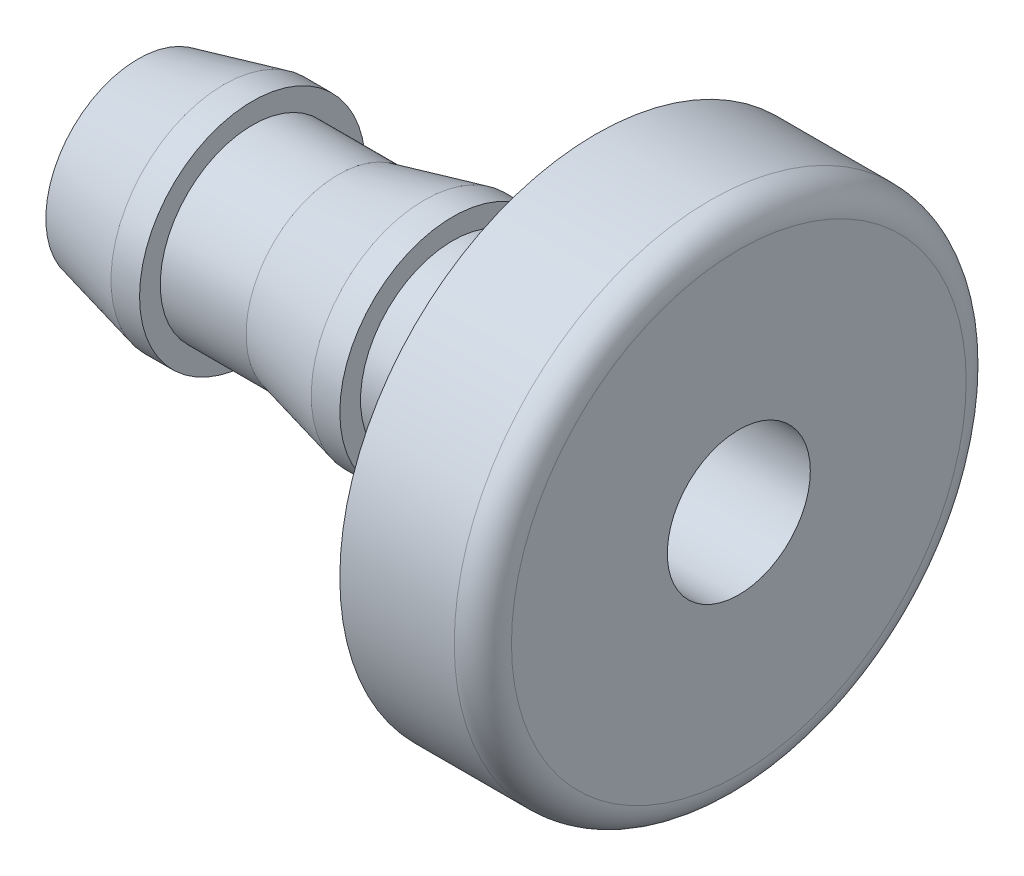
ISO-10303-21;
HEADER;
FILE_DESCRIPTION(('STEP AP214'),'2;1');
FILE_NAME('part.step','',(''),(''),'','','');
FILE_SCHEMA(('AUTOMOTIVE_DESIGN { 1 0 10303 214 1 1 1 1 }'));
ENDSEC;
DATA;
#1=APPLICATION_CONTEXT('core data for automotive mechanical design processes');
#2=APPLICATION_PROTOCOL_DEFINITION('international standard','automotive_design',2000,#1);
#3=PRODUCT_CONTEXT('',#1,'mechanical');
#4=PRODUCT('Part','Part','',(#3));
#5=PRODUCT_RELATED_PRODUCT_CATEGORY('part','',(#4));
#6=PRODUCT_DEFINITION_FORMATION('','',#4);
#7=PRODUCT_DEFINITION_CONTEXT('part definition',#1,'design');
#8=PRODUCT_DEFINITION('design','',#6,#7);
#9=PRODUCT_DEFINITION_SHAPE('','',#8);
#10=(LENGTH_UNIT() NAMED_UNIT(*) SI_UNIT(.MILLI.,.METRE.));
#11=(NAMED_UNIT(*) PLANE_ANGLE_UNIT() SI_UNIT($,.RADIAN.));
#12=(NAMED_UNIT(*) SI_UNIT($,.STERADIAN.) SOLID_ANGLE_UNIT());
#13=UNCERTAINTY_MEASURE_WITH_UNIT(LENGTH_MEASURE(1.E-05),#10,'distance_accuracy_value','');
#14=(GEOMETRIC_REPRESENTATION_CONTEXT(3) GLOBAL_UNCERTAINTY_ASSIGNED_CONTEXT((#13)) GLOBAL_UNIT_ASSIGNED_CONTEXT((#10,
#11,#12)) REPRESENTATION_CONTEXT('',''));
#15=CARTESIAN_POINT('',(0.,0.,0.));
#16=DIRECTION('',(0.,0.,1.));
#17=DIRECTION('',(1.,0.,0.));
#18=AXIS2_PLACEMENT_3D('',#15,#16,#17);
#19=CARTESIAN_POINT('',(10.6172,3.46074999999988,0.));
#20=DIRECTION('',(1.,0.,0.));
#21=DIRECTION('',(0.,0.,-1.));
#22=AXIS2_PLACEMENT_3D('',#19,#20,#21);
#23=PLANE('',#22);
#24=CARTESIAN_POINT('',(10.6172,0.,0.));
#25=DIRECTION('',(1.,0.,0.));
#26=DIRECTION('',(0.,0.,-1.));
#27=AXIS2_PLACEMENT_3D('',#24,#25,#26);
#28=CIRCLE('',#27,3.80999999999995);
#29=CARTESIAN_POINT('',(10.6172,0.,-3.81000000000001));
#30=VERTEX_POINT('',#29);
#31=EDGE_CURVE('E120',#30,#30,#28,.F.);
#32=ORIENTED_EDGE('',*,*,#31,.F.);
#33=EDGE_LOOP('',(#32));
#34=FACE_BOUND('',#33,.T.);
#35=CARTESIAN_POINT('',(10.6172,0.,0.));
#36=DIRECTION('',(1.,0.,0.));
#37=DIRECTION('',(0.,0.,-1.));
#38=AXIS2_PLACEMENT_3D('',#35,#36,#37);
#39=CIRCLE('',#38,3.11149999999995);
#40=CARTESIAN_POINT('',(10.6172,0.,-3.11150000000001));
#41=VERTEX_POINT('',#40);
#42=EDGE_CURVE('E96',#41,#41,#39,.T.);
#43=ORIENTED_EDGE('',*,*,#42,.F.);
#44=EDGE_LOOP('',(#43));
#45=FACE_BOUND('',#44,.T.);
#46=ADVANCED_FACE('F16',(#34,#45),#23,.T.);
#47=CARTESIAN_POINT('',(10.1346,0.,0.));
#48=DIRECTION('',(1.,0.,0.));
#49=DIRECTION('',(0.,0.,-1.));
#50=AXIS2_PLACEMENT_3D('',#47,#48,#49);
#51=CYLINDRICAL_SURFACE('',#50,3.80999999999995);
#52=ORIENTED_EDGE('',*,*,#31,.T.);
#53=EDGE_LOOP('',(#52));
#54=FACE_BOUND('',#53,.T.);
#55=CARTESIAN_POINT('',(9.65199999996003,0.,0.));
#56=DIRECTION('',(1.,0.,0.));
#57=DIRECTION('',(0.,1.,0.));
#58=AXIS2_PLACEMENT_3D('',#55,#56,#57);
#59=CIRCLE('',#58,3.81000000000149);
#60=CARTESIAN_POINT('',(9.65199999996003,3.81000000000142,0.));
#61=VERTEX_POINT('',#60);
#62=EDGE_CURVE('E93',#61,#61,#59,.F.);
#63=ORIENTED_EDGE('',*,*,#62,.F.);
#64=EDGE_LOOP('',(#63));
#65=FACE_BOUND('',#64,.T.);
#66=ADVANCED_FACE('F124',(#54,#65),#51,.T.);
#67=CARTESIAN_POINT('',(13.0302,0.,0.));
#68=DIRECTION('',(1.,0.,0.));
#69=DIRECTION('',(0.,0.,-1.));
#70=AXIS2_PLACEMENT_3D('',#67,#68,#69);
#71=CYLINDRICAL_SURFACE('',#70,3.11149999999995);
#72=CARTESIAN_POINT('',(15.4432000000497,0.,0.));
#73=DIRECTION('',(1.,0.,0.));
#74=DIRECTION('',(0.,1.,0.));
#75=AXIS2_PLACEMENT_3D('',#72,#73,#74);
#76=CIRCLE('',#75,3.11150000000289);
#77=CARTESIAN_POINT('',(15.4432000000497,3.11150000000282,0.));
#78=VERTEX_POINT('',#77);
#79=EDGE_CURVE('E90',#78,#78,#76,.T.);
#80=ORIENTED_EDGE('',*,*,#79,.F.);
#81=EDGE_LOOP('',(#80));
#82=FACE_BOUND('',#81,.T.);
#83=ORIENTED_EDGE('',*,*,#42,.T.);
#84=EDGE_LOOP('',(#83));
#85=FACE_BOUND('',#84,.T.);
#86=ADVANCED_FACE('F131',(#82,#85),#71,.T.);
#87=CARTESIAN_POINT('',(9.65199999996003,0.,0.));
#88=DIRECTION('',(1.,0.,0.));
#89=DIRECTION('',(0.,0.,-1.));
#90=AXIS2_PLACEMENT_3D('',#87,#88,#89);
#91=CONICAL_SURFACE('',#90,3.81000000000149,0.236705842554622);
#92=ORIENTED_EDGE('',*,*,#62,.T.);
#93=EDGE_LOOP('',(#92));
#94=FACE_BOUND('',#93,.T.);
#95=CARTESIAN_POINT('',(6.75639999999998,0.,0.));
#96=DIRECTION('',(1.,0.,0.));
#97=DIRECTION('',(0.,0.,-1.));
#98=AXIS2_PLACEMENT_3D('',#95,#96,#97);
#99=CIRCLE('',#98,3.1114999999999);
#100=CARTESIAN_POINT('',(6.75639999999998,0.,-3.11149999999996));
#101=VERTEX_POINT('',#100);
#102=EDGE_CURVE('E87',#101,#101,#99,.F.);
#103=ORIENTED_EDGE('',*,*,#102,.F.);
#104=EDGE_LOOP('',(#103));
#105=FACE_BOUND('',#104,.T.);
#106=ADVANCED_FACE('F133',(#94,#105),#91,.T.);
#107=CARTESIAN_POINT('',(18.3387999997535,0.,0.));
#108=DIRECTION('',(1.,0.,0.));
#109=DIRECTION('',(0.,0.,-1.));
#110=AXIS2_PLACEMENT_3D('',#107,#108,#109);
#111=CONICAL_SURFACE('',#110,3.80999999993044,0.236705842549984);
#112=CARTESIAN_POINT('',(18.3388,0.,0.));
#113=DIRECTION('',(1.,0.,0.));
#114=DIRECTION('',(0.,0.,-1.));
#115=AXIS2_PLACEMENT_3D('',#112,#113,#114);
#116=CIRCLE('',#115,3.80999999999999);
#117=CARTESIAN_POINT('',(18.3388,0.,-3.81000000000005));
#118=VERTEX_POINT('',#117);
#119=EDGE_CURVE('E83',#118,#118,#116,.T.);
#120=ORIENTED_EDGE('',*,*,#119,.F.);
#121=EDGE_LOOP('',(#120));
#122=FACE_BOUND('',#121,.T.);
#123=ORIENTED_EDGE('',*,*,#79,.T.);
#124=EDGE_LOOP('',(#123));
#125=FACE_BOUND('',#124,.T.);
#126=ADVANCED_FACE('F141',(#122,#125),#111,.T.);
#127=CARTESIAN_POINT('',(5.30859999999997,0.,0.));
#128=DIRECTION('',(1.,0.,0.));
#129=DIRECTION('',(0.,0.,-1.));
#130=AXIS2_PLACEMENT_3D('',#127,#128,#129);
#131=CYLINDRICAL_SURFACE('',#130,3.1114999999999);
#132=ORIENTED_EDGE('',*,*,#102,.T.);
#133=EDGE_LOOP('',(#132));
#134=FACE_BOUND('',#133,.T.);
#135=CARTESIAN_POINT('',(3.86079999999996,0.,0.));
#136=DIRECTION('',(1.,0.,0.));
#137=DIRECTION('',(0.,0.,-1.));
#138=AXIS2_PLACEMENT_3D('',#135,#136,#137);
#139=CIRCLE('',#138,3.1114999999999);
#140=CARTESIAN_POINT('',(3.86079999999996,0.,-3.11149999999996));
#141=VERTEX_POINT('',#140);
#142=EDGE_CURVE('E86',#141,#141,#139,.F.);
#143=ORIENTED_EDGE('',*,*,#142,.F.);
#144=EDGE_LOOP('',(#143));
#145=FACE_BOUND('',#144,.T.);
#146=ADVANCED_FACE('F148',(#134,#145),#131,.T.);
#147=CARTESIAN_POINT('',(18.8214,0.,0.));
#148=DIRECTION('',(1.,0.,0.));
#149=DIRECTION('',(0.,0.,-1.));
#150=AXIS2_PLACEMENT_3D('',#147,#148,#149);
#151=CYLINDRICAL_SURFACE('',#150,3.80999999999999);
#152=CARTESIAN_POINT('',(19.304,0.,0.));
#153=DIRECTION('',(1.,0.,0.));
#154=DIRECTION('',(0.,0.,-1.));
#155=AXIS2_PLACEMENT_3D('',#152,#153,#154);
#156=CIRCLE('',#155,3.80999999999999);
#157=CARTESIAN_POINT('',(19.304,0.,-3.81000000000005));
#158=VERTEX_POINT('',#157);
#159=EDGE_CURVE('E114',#158,#158,#156,.T.);
#160=ORIENTED_EDGE('',*,*,#159,.F.);
#161=EDGE_LOOP('',(#160));
#162=FACE_BOUND('',#161,.T.);
#163=ORIENTED_EDGE('',*,*,#119,.T.);
#164=EDGE_LOOP('',(#163));
#165=FACE_BOUND('',#164,.T.);
#166=ADVANCED_FACE('F152',(#162,#165),#151,.T.);
#167=CARTESIAN_POINT('',(3.86079999999996,3.46074999999985,0.));
#168=DIRECTION('',(1.,0.,0.));
#169=DIRECTION('',(0.,0.,-1.));
#170=AXIS2_PLACEMENT_3D('',#167,#168,#169);
#171=PLANE('',#170);
#172=CARTESIAN_POINT('',(3.86079999999996,0.,0.));
#173=DIRECTION('',(1.,0.,0.));
#174=DIRECTION('',(0.,0.,-1.));
#175=AXIS2_PLACEMENT_3D('',#172,#173,#174);
#176=CIRCLE('',#175,3.80999999999992);
#177=CARTESIAN_POINT('',(3.86079999999996,0.,-3.80999999999998));
#178=VERTEX_POINT('',#177);
#179=EDGE_CURVE('E111',#178,#178,#176,.F.);
#180=ORIENTED_EDGE('',*,*,#179,.F.);
#181=EDGE_LOOP('',(#180));
#182=FACE_BOUND('',#181,.T.);
#183=ORIENTED_EDGE('',*,*,#142,.T.);
#184=EDGE_LOOP('',(#183));
#185=FACE_BOUND('',#184,.T.);
#186=ADVANCED_FACE('F156',(#182,#185),#171,.T.);
#187=CARTESIAN_POINT('',(19.304,5.74039999999991,0.));
#188=DIRECTION('',(-1.,0.,0.));
#189=DIRECTION('',(0.,0.,1.));
#190=AXIS2_PLACEMENT_3D('',#187,#188,#189);
#191=PLANE('',#190);
#192=ORIENTED_EDGE('',*,*,#159,.T.);
#193=EDGE_LOOP('',(#192));
#194=FACE_BOUND('',#193,.T.);
#195=CARTESIAN_POINT('',(19.304,0.,0.));
#196=DIRECTION('',(1.,0.,0.));
#197=DIRECTION('',(0.,0.,-1.));
#198=AXIS2_PLACEMENT_3D('',#195,#196,#197);
#199=CIRCLE('',#198,7.67079999999997);
#200=CARTESIAN_POINT('',(19.304,0.,-7.67080000000003));
#201=VERTEX_POINT('',#200);
#202=EDGE_CURVE('E82',#201,#201,#199,.F.);
#203=ORIENTED_EDGE('',*,*,#202,.T.);
#204=EDGE_LOOP('',(#203));
#205=FACE_BOUND('',#204,.T.);
#206=ADVANCED_FACE('F160',(#194,#205),#191,.T.);
#207=CARTESIAN_POINT('',(3.37819999999994,0.,0.));
#208=DIRECTION('',(1.,0.,0.));
#209=DIRECTION('',(0.,0.,-1.));
#210=AXIS2_PLACEMENT_3D('',#207,#208,#209);
#211=CYLINDRICAL_SURFACE('',#210,3.80999999999992);
#212=ORIENTED_EDGE('',*,*,#179,.T.);
#213=EDGE_LOOP('',(#212));
#214=FACE_BOUND('',#213,.T.);
#215=CARTESIAN_POINT('',(2.89559999998801,0.,0.));
#216=DIRECTION('',(1.,0.,0.));
#217=DIRECTION('',(0.,1.,0.));
#218=AXIS2_PLACEMENT_3D('',#215,#216,#217);
#219=CIRCLE('',#218,3.81000000000149);
#220=CARTESIAN_POINT('',(2.89559999998801,3.81000000000142,0.));
#221=VERTEX_POINT('',#220);
#222=EDGE_CURVE('E78',#221,#221,#219,.F.);
#223=ORIENTED_EDGE('',*,*,#222,.F.);
#224=EDGE_LOOP('',(#223));
#225=FACE_BOUND('',#224,.T.);
#226=ADVANCED_FACE('F164',(#214,#225),#211,.T.);
#227=CARTESIAN_POINT('',(17.3736,0.,0.));
#228=DIRECTION('',(1.,0.,0.));
#229=DIRECTION('',(0.,0.,-1.));
#230=AXIS2_PLACEMENT_3D('',#227,#228,#229);
#231=CYLINDRICAL_SURFACE('',#230,7.67079999999997);
#232=CARTESIAN_POINT('',(15.4432000000001,0.,0.));
#233=DIRECTION('',(1.,0.,0.));
#234=DIRECTION('',(0.,0.,-1.));
#235=AXIS2_PLACEMENT_3D('',#232,#233,#234);
#236=CIRCLE('',#235,7.67079999999997);
#237=CARTESIAN_POINT('',(15.4432000000001,0.,-7.67080000000003));
#238=VERTEX_POINT('',#237);
#239=EDGE_CURVE('E81',#238,#238,#236,.T.);
#240=ORIENTED_EDGE('',*,*,#239,.F.);
#241=EDGE_LOOP('',(#240));
#242=FACE_BOUND('',#241,.T.);
#243=ORIENTED_EDGE('',*,*,#202,.F.);
#244=EDGE_LOOP('',(#243));
#245=FACE_BOUND('',#244,.T.);
#246=ADVANCED_FACE('F168',(#242,#245),#231,.F.);
#247=CARTESIAN_POINT('',(2.89559999998801,0.,0.));
#248=DIRECTION('',(1.,0.,0.));
#249=DIRECTION('',(0.,0.,-1.));
#250=AXIS2_PLACEMENT_3D('',#247,#248,#249);
#251=CONICAL_SURFACE('',#250,3.81000000000149,0.236705842559422);
#252=ORIENTED_EDGE('',*,*,#222,.T.);
#253=EDGE_LOOP('',(#252));
#254=FACE_BOUND('',#253,.T.);
#255=CARTESIAN_POINT('',(0.,0.,0.));
#256=DIRECTION('',(1.,0.,0.));
#257=DIRECTION('',(0.,0.,-1.));
#258=AXIS2_PLACEMENT_3D('',#255,#256,#257);
#259=CIRCLE('',#258,3.11149999998867);
#260=CARTESIAN_POINT('',(0.,0.,-3.11149999998873));
#261=VERTEX_POINT('',#260);
#262=EDGE_CURVE('E104',#261,#261,#259,.F.);
#263=ORIENTED_EDGE('',*,*,#262,.F.);
#264=EDGE_LOOP('',(#263));
#265=FACE_BOUND('',#264,.T.);
#266=ADVANCED_FACE('F172',(#254,#265),#251,.T.);
#267=CARTESIAN_POINT('',(15.4432000000001,8.15339999999991,0.));
#268=DIRECTION('',(-1.,0.,0.));
#269=DIRECTION('',(0.,0.,1.));
#270=AXIS2_PLACEMENT_3D('',#267,#268,#269);
#271=PLANE('',#270);
#272=ORIENTED_EDGE('',*,*,#239,.T.);
#273=EDGE_LOOP('',(#272));
#274=FACE_BOUND('',#273,.T.);
#275=CARTESIAN_POINT('',(15.4432000000001,0.,0.));
#276=DIRECTION('',(1.,0.,0.));
#277=DIRECTION('',(0.,0.,-1.));
#278=AXIS2_PLACEMENT_3D('',#275,#276,#277);
#279=CIRCLE('',#278,8.63599999999999);
#280=CARTESIAN_POINT('',(15.4432000000001,0.,-8.63600000000005));
#281=VERTEX_POINT('',#280);
#282=EDGE_CURVE('E101',#281,#281,#279,.T.);
#283=ORIENTED_EDGE('',*,*,#282,.F.);
#284=EDGE_LOOP('',(#283));
#285=FACE_BOUND('',#284,.T.);
#286=ADVANCED_FACE('F176',(#274,#285),#271,.T.);
#287=CARTESIAN_POINT('',(0.,2.76224999999982,0.));
#288=DIRECTION('',(-1.,0.,0.));
#289=DIRECTION('',(0.,0.,1.));
#290=AXIS2_PLACEMENT_3D('',#287,#288,#289);
#291=PLANE('',#290);
#292=CARTESIAN_POINT('',(0.,0.,0.));
#293=DIRECTION('',(1.,0.,0.));
#294=DIRECTION('',(0.,0.,-1.));
#295=AXIS2_PLACEMENT_3D('',#292,#293,#294);
#296=CIRCLE('',#295,2.41299999999994);
#297=CARTESIAN_POINT('',(0.,0.,-2.413));
#298=VERTEX_POINT('',#297);
#299=EDGE_CURVE('E77',#298,#298,#296,.T.);
#300=ORIENTED_EDGE('',*,*,#299,.T.);
#301=EDGE_LOOP('',(#300));
#302=FACE_BOUND('',#301,.T.);
#303=ORIENTED_EDGE('',*,*,#262,.T.);
#304=EDGE_LOOP('',(#303));
#305=FACE_BOUND('',#304,.T.);
#306=ADVANCED_FACE('F180',(#302,#305),#291,.T.);
#307=CARTESIAN_POINT('',(17.3736,0.,0.));
#308=DIRECTION('',(1.,0.,0.));
#309=DIRECTION('',(0.,0.,-1.));
#310=AXIS2_PLACEMENT_3D('',#307,#308,#309);
#311=CYLINDRICAL_SURFACE('',#310,8.63599999999999);
#312=CARTESIAN_POINT('',(19.304,0.,0.));
#313=DIRECTION('',(1.,0.,0.));
#314=DIRECTION('',(0.,1.,0.));
#315=AXIS2_PLACEMENT_3D('',#312,#313,#314);
#316=CIRCLE('',#315,8.636);
#317=CARTESIAN_POINT('',(19.304,8.63599999999993,0.));
#318=VERTEX_POINT('',#317);
#319=EDGE_CURVE('E69',#318,#318,#316,.T.);
#320=ORIENTED_EDGE('',*,*,#319,.F.);
#321=EDGE_LOOP('',(#320));
#322=FACE_BOUND('',#321,.T.);
#323=ORIENTED_EDGE('',*,*,#282,.T.);
#324=EDGE_LOOP('',(#323));
#325=FACE_BOUND('',#324,.T.);
#326=ADVANCED_FACE('F183',(#322,#325),#311,.T.);
#327=CARTESIAN_POINT('',(10.1346,0.,0.));
#328=DIRECTION('',(1.,0.,0.));
#329=DIRECTION('',(0.,0.,-1.));
#330=AXIS2_PLACEMENT_3D('',#327,#328,#329);
#331=CYLINDRICAL_SURFACE('',#330,2.41299999999994);
#332=ORIENTED_EDGE('',*,*,#299,.F.);
#333=EDGE_LOOP('',(#332));
#334=FACE_BOUND('',#333,.T.);
#335=CARTESIAN_POINT('',(20.2692000000001,0.,0.));
#336=DIRECTION('',(1.,0.,0.));
#337=DIRECTION('',(0.,0.,-1.));
#338=AXIS2_PLACEMENT_3D('',#335,#336,#337);
#339=CIRCLE('',#338,2.41299999999994);
#340=CARTESIAN_POINT('',(20.2692000000001,0.,-2.413));
#341=VERTEX_POINT('',#340);
#342=EDGE_CURVE('E37',#341,#341,#339,.F.);
#343=ORIENTED_EDGE('',*,*,#342,.F.);
#344=EDGE_LOOP('',(#343));
#345=FACE_BOUND('',#344,.T.);
#346=ADVANCED_FACE('F62',(#334,#345),#331,.F.);
#347=CARTESIAN_POINT('',(19.304,0.,0.));
#348=DIRECTION('',(1.,0.,0.));
#349=DIRECTION('',(0.,1.,0.));
#350=AXIS2_PLACEMENT_3D('',#347,#348,#349);
#351=TOROIDAL_SURFACE('',#350,7.67079999999997,0.965200000000029);
#352=CARTESIAN_POINT('',(20.2692,0.,0.));
#353=DIRECTION('',(-1.,0.,0.));
#354=DIRECTION('',(0.,-1.,0.));
#355=AXIS2_PLACEMENT_3D('',#352,#353,#354);
#356=CIRCLE('',#355,7.67079999999997);
#357=CARTESIAN_POINT('',(20.2692000000001,7.6707999999999,0.));
#358=VERTEX_POINT('',#357);
#359=CARTESIAN_POINT('',(20.2692000000001,-7.67080000000004,0.));
#360=VERTEX_POINT('',#359);
#361=EDGE_CURVE('E27',#358,#360,#356,.F.);
#362=ORIENTED_EDGE('',*,*,#361,.F.);
#363=CARTESIAN_POINT('',(20.2692,0.,0.));
#364=DIRECTION('',(-1.,0.,0.));
#365=DIRECTION('',(0.,1.,0.));
#366=AXIS2_PLACEMENT_3D('',#363,#364,#365);
#367=CIRCLE('',#366,7.67079999999997);
#368=EDGE_CURVE('E11',#360,#358,#367,.F.);
#369=ORIENTED_EDGE('',*,*,#368,.F.);
#370=EDGE_LOOP('',(#362,#369));
#371=FACE_BOUND('',#370,.T.);
#372=ORIENTED_EDGE('',*,*,#319,.T.);
#373=EDGE_LOOP('',(#372));
#374=FACE_BOUND('',#373,.T.);
#375=ADVANCED_FACE('F33',(#371,#374),#351,.T.);
#376=CARTESIAN_POINT('',(20.2692000000001,5.04189999999991,0.));
#377=DIRECTION('',(1.,0.,0.));
#378=DIRECTION('',(0.,0.,-1.));
#379=AXIS2_PLACEMENT_3D('',#376,#377,#378);
#380=PLANE('',#379);
#381=ORIENTED_EDGE('',*,*,#361,.T.);
#382=ORIENTED_EDGE('',*,*,#368,.T.);
#383=EDGE_LOOP('',(#381,#382));
#384=FACE_BOUND('',#383,.T.);
#385=ORIENTED_EDGE('',*,*,#342,.T.);
#386=EDGE_LOOP('',(#385));
#387=FACE_BOUND('',#386,.T.);
#388=ADVANCED_FACE('F40',(#384,#387),#380,.T.);
#389=CLOSED_SHELL('',(#46,#66,#86,#106,#126,#146,#166,#186,#206,#226,#246,#266,#286,#306,#326,
#346,#375,#388));
#390=MANIFOLD_SOLID_BREP('B1',#389);
#391=ADVANCED_BREP_SHAPE_REPRESENTATION('',(#18,#390),#14);
#392=SHAPE_DEFINITION_REPRESENTATION(#9,#391);
ENDSEC;
END-ISO-10303-21;
